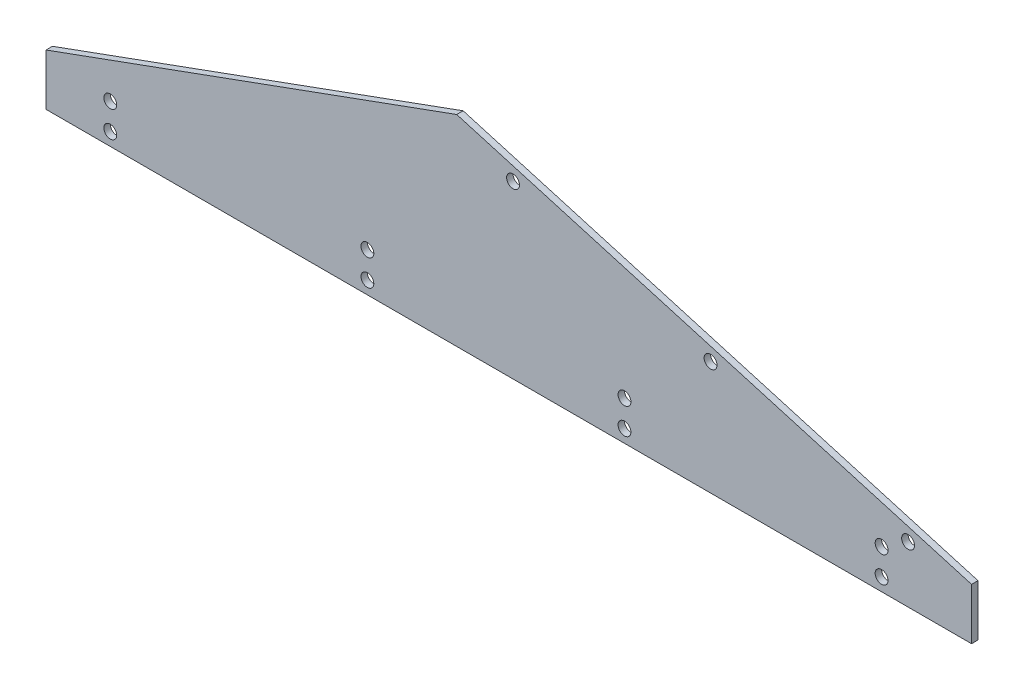
ISO-10303-21;
HEADER;
FILE_DESCRIPTION(('STEP AP214'),'2;1');
FILE_NAME('part.step','',(''),(''),'','','');
FILE_SCHEMA(('AUTOMOTIVE_DESIGN { 1 0 10303 214 1 1 1 1 }'));
ENDSEC;
DATA;
#1=APPLICATION_CONTEXT('core data for automotive mechanical design processes');
#2=APPLICATION_PROTOCOL_DEFINITION('international standard','automotive_design',2000,#1);
#3=PRODUCT_CONTEXT('',#1,'mechanical');
#4=PRODUCT('Part','Part','',(#3));
#5=PRODUCT_RELATED_PRODUCT_CATEGORY('part','',(#4));
#6=PRODUCT_DEFINITION_FORMATION('','',#4);
#7=PRODUCT_DEFINITION_CONTEXT('part definition',#1,'design');
#8=PRODUCT_DEFINITION('design','',#6,#7);
#9=PRODUCT_DEFINITION_SHAPE('','',#8);
#10=(LENGTH_UNIT() NAMED_UNIT(*) SI_UNIT(.MILLI.,.METRE.));
#11=(NAMED_UNIT(*) PLANE_ANGLE_UNIT() SI_UNIT($,.RADIAN.));
#12=(NAMED_UNIT(*) SI_UNIT($,.STERADIAN.) SOLID_ANGLE_UNIT());
#13=UNCERTAINTY_MEASURE_WITH_UNIT(LENGTH_MEASURE(1.E-05),#10,'distance_accuracy_value','');
#14=(GEOMETRIC_REPRESENTATION_CONTEXT(3) GLOBAL_UNCERTAINTY_ASSIGNED_CONTEXT((#13)) GLOBAL_UNIT_ASSIGNED_CONTEXT((#10,
#11,#12)) REPRESENTATION_CONTEXT('',''));
#15=CARTESIAN_POINT('',(0.,0.,0.));
#16=DIRECTION('',(0.,0.,1.));
#17=DIRECTION('',(1.,0.,0.));
#18=AXIS2_PLACEMENT_3D('',#15,#16,#17);
#19=CARTESIAN_POINT('',(0.,0.,3.175));
#20=DIRECTION('',(0.,0.,1.));
#21=DIRECTION('',(1.,0.,0.));
#22=AXIS2_PLACEMENT_3D('',#19,#20,#21);
#23=PLANE('',#22);
#24=CARTESIAN_POINT('',(285.75,6.35,3.175));
#25=DIRECTION('',(0.,0.,1.));
#26=DIRECTION('',(1.,0.,0.));
#27=AXIS2_PLACEMENT_3D('',#24,#25,#26);
#28=CIRCLE('',#27,3.17499999999997);
#29=CARTESIAN_POINT('',(288.925,6.35,3.175));
#30=VERTEX_POINT('',#29);
#31=EDGE_CURVE('E210',#30,#30,#28,.T.);
#32=ORIENTED_EDGE('',*,*,#31,.F.);
#33=EDGE_LOOP('',(#32));
#34=FACE_BOUND('',#33,.T.);
#35=CARTESIAN_POINT('',(412.75,19.3018477189735,3.175));
#36=DIRECTION('',(0.,0.,1.));
#37=DIRECTION('',(1.,0.,0.));
#38=AXIS2_PLACEMENT_3D('',#35,#36,#37);
#39=CIRCLE('',#38,3.17499999999997);
#40=CARTESIAN_POINT('',(415.925,19.3018477189735,3.175));
#41=VERTEX_POINT('',#40);
#42=EDGE_CURVE('E222',#41,#41,#39,.T.);
#43=ORIENTED_EDGE('',*,*,#42,.F.);
#44=EDGE_LOOP('',(#43));
#45=FACE_BOUND('',#44,.T.);
#46=CARTESIAN_POINT('',(158.75,19.3018477189735,3.175));
#47=DIRECTION('',(0.,0.,1.));
#48=DIRECTION('',(1.,0.,0.));
#49=AXIS2_PLACEMENT_3D('',#46,#47,#48);
#50=CIRCLE('',#49,3.175);
#51=CARTESIAN_POINT('',(161.925,19.3018477189735,3.175));
#52=VERTEX_POINT('',#51);
#53=EDGE_CURVE('E234',#52,#52,#50,.T.);
#54=ORIENTED_EDGE('',*,*,#53,.F.);
#55=EDGE_LOOP('',(#54));
#56=FACE_BOUND('',#55,.T.);
#57=CARTESIAN_POINT('',(31.75,19.3018477189735,3.175));
#58=DIRECTION('',(0.,0.,1.));
#59=DIRECTION('',(1.,0.,0.));
#60=AXIS2_PLACEMENT_3D('',#57,#58,#59);
#61=CIRCLE('',#60,3.175);
#62=CARTESIAN_POINT('',(34.925,19.3018477189735,3.175));
#63=VERTEX_POINT('',#62);
#64=EDGE_CURVE('E246',#63,#63,#61,.T.);
#65=ORIENTED_EDGE('',*,*,#64,.F.);
#66=EDGE_LOOP('',(#65));
#67=FACE_BOUND('',#66,.T.);
#68=CARTESIAN_POINT('',(328.269214348156,56.2229221909792,3.175));
#69=DIRECTION('',(0.,0.,1.));
#70=DIRECTION('',(1.,0.,0.));
#71=AXIS2_PLACEMENT_3D('',#68,#69,#70);
#72=CIRCLE('',#71,3.17499999999997);
#73=CARTESIAN_POINT('',(331.444214348156,56.2229221909792,3.175));
#74=VERTEX_POINT('',#73);
#75=EDGE_CURVE('E258',#74,#74,#72,.T.);
#76=ORIENTED_EDGE('',*,*,#75,.F.);
#77=EDGE_LOOP('',(#76));
#78=FACE_BOUND('',#77,.T.);
#79=DIRECTION('',(0.,-1.,0.));
#80=VECTOR('',#79,1.);
#81=CARTESIAN_POINT('',(0.,25.4,3.175));
#82=LINE('',#81,#80);
#83=CARTESIAN_POINT('',(0.,25.4,3.175));
#84=VERTEX_POINT('',#83);
#85=CARTESIAN_POINT('',(0.,0.,3.175));
#86=VERTEX_POINT('',#85);
#87=EDGE_CURVE('E127',#84,#86,#82,.T.);
#88=ORIENTED_EDGE('',*,*,#87,.T.);
#89=DIRECTION('',(1.,0.,0.));
#90=VECTOR('',#89,1.);
#91=CARTESIAN_POINT('',(0.,0.,3.175));
#92=LINE('',#91,#90);
#93=CARTESIAN_POINT('',(457.2,0.,3.175));
#94=VERTEX_POINT('',#93);
#95=EDGE_CURVE('E94',#86,#94,#92,.T.);
#96=ORIENTED_EDGE('',*,*,#95,.T.);
#97=DIRECTION('',(0.,1.,0.));
#98=VECTOR('',#97,1.);
#99=CARTESIAN_POINT('',(457.2,0.,3.175));
#100=LINE('',#99,#98);
#101=CARTESIAN_POINT('',(457.2,25.4,3.175));
#102=VERTEX_POINT('',#101);
#103=EDGE_CURVE('E98',#94,#102,#100,.T.);
#104=ORIENTED_EDGE('',*,*,#103,.T.);
#105=DIRECTION('',(-0.960338941893926,0.278835285934285,0.));
#106=VECTOR('',#105,1.);
#107=CARTESIAN_POINT('',(457.2,25.4,3.175));
#108=LINE('',#107,#106);
#109=CARTESIAN_POINT('',(202.879636827678,99.2421489440113,3.175));
#110=VERTEX_POINT('',#109);
#111=EDGE_CURVE('E102',#102,#110,#108,.T.);
#112=ORIENTED_EDGE('',*,*,#111,.T.);
#113=DIRECTION('',(-0.939692620785909,-0.342020143325666,0.));
#114=VECTOR('',#113,1.);
#115=CARTESIAN_POINT('',(202.879636827678,99.2421489440113,3.175));
#116=LINE('',#115,#114);
#117=EDGE_CURVE('E60',#110,#84,#116,.T.);
#118=ORIENTED_EDGE('',*,*,#117,.T.);
#119=EDGE_LOOP('',(#88,#96,#104,#112,#118));
#120=FACE_BOUND('',#119,.T.);
#121=CARTESIAN_POINT('',(230.698777851733,84.5525872419025,3.175));
#122=DIRECTION('',(0.,0.,1.));
#123=DIRECTION('',(1.,0.,0.));
#124=AXIS2_PLACEMENT_3D('',#121,#122,#123);
#125=CIRCLE('',#124,3.17499999999997);
#126=CARTESIAN_POINT('',(233.873777851733,84.5525872419025,3.175));
#127=VERTEX_POINT('',#126);
#128=EDGE_CURVE('E122',#127,#127,#125,.T.);
#129=ORIENTED_EDGE('',*,*,#128,.F.);
#130=EDGE_LOOP('',(#129));
#131=FACE_BOUND('',#130,.T.);
#132=CARTESIAN_POINT('',(425.839650844579,27.8932571400559,3.175));
#133=DIRECTION('',(0.,0.,1.));
#134=DIRECTION('',(1.,0.,0.));
#135=AXIS2_PLACEMENT_3D('',#132,#133,#134);
#136=CIRCLE('',#135,3.17499999999997);
#137=CARTESIAN_POINT('',(429.014650844579,27.8932571400559,3.175));
#138=VERTEX_POINT('',#137);
#139=EDGE_CURVE('E252',#138,#138,#136,.T.);
#140=ORIENTED_EDGE('',*,*,#139,.F.);
#141=EDGE_LOOP('',(#140));
#142=FACE_BOUND('',#141,.T.);
#143=CARTESIAN_POINT('',(31.75,6.35,3.175));
#144=DIRECTION('',(0.,0.,1.));
#145=DIRECTION('',(1.,0.,0.));
#146=AXIS2_PLACEMENT_3D('',#143,#144,#145);
#147=CIRCLE('',#146,3.175);
#148=CARTESIAN_POINT('',(34.925,6.35,3.175));
#149=VERTEX_POINT('',#148);
#150=EDGE_CURVE('E240',#149,#149,#147,.T.);
#151=ORIENTED_EDGE('',*,*,#150,.F.);
#152=EDGE_LOOP('',(#151));
#153=FACE_BOUND('',#152,.T.);
#154=CARTESIAN_POINT('',(285.75,19.3018477189735,3.175));
#155=DIRECTION('',(0.,0.,1.));
#156=DIRECTION('',(1.,0.,0.));
#157=AXIS2_PLACEMENT_3D('',#154,#155,#156);
#158=CIRCLE('',#157,3.17499999999997);
#159=CARTESIAN_POINT('',(288.925,19.3018477189735,3.175));
#160=VERTEX_POINT('',#159);
#161=EDGE_CURVE('E228',#160,#160,#158,.T.);
#162=ORIENTED_EDGE('',*,*,#161,.F.);
#163=EDGE_LOOP('',(#162));
#164=FACE_BOUND('',#163,.T.);
#165=CARTESIAN_POINT('',(158.75,6.35,3.175));
#166=DIRECTION('',(0.,0.,1.));
#167=DIRECTION('',(1.,0.,0.));
#168=AXIS2_PLACEMENT_3D('',#165,#166,#167);
#169=CIRCLE('',#168,3.175);
#170=CARTESIAN_POINT('',(161.925,6.35,3.175));
#171=VERTEX_POINT('',#170);
#172=EDGE_CURVE('E216',#171,#171,#169,.T.);
#173=ORIENTED_EDGE('',*,*,#172,.F.);
#174=EDGE_LOOP('',(#173));
#175=FACE_BOUND('',#174,.T.);
#176=CARTESIAN_POINT('',(412.75,6.35,3.175));
#177=DIRECTION('',(0.,0.,1.));
#178=DIRECTION('',(1.,0.,0.));
#179=AXIS2_PLACEMENT_3D('',#176,#177,#178);
#180=CIRCLE('',#179,3.17499999999997);
#181=CARTESIAN_POINT('',(415.925,6.35,3.175));
#182=VERTEX_POINT('',#181);
#183=EDGE_CURVE('E201',#182,#182,#180,.T.);
#184=ORIENTED_EDGE('',*,*,#183,.F.);
#185=EDGE_LOOP('',(#184));
#186=FACE_BOUND('',#185,.T.);
#187=ADVANCED_FACE('F43',(#34,#45,#56,#67,#78,#120,#131,#142,#153,#164,#175,#186),#23,.T.);
#188=CARTESIAN_POINT('',(0.,0.,0.));
#189=DIRECTION('',(0.,0.,1.));
#190=DIRECTION('',(1.,0.,0.));
#191=AXIS2_PLACEMENT_3D('',#188,#189,#190);
#192=PLANE('',#191);
#193=DIRECTION('',(0.,-1.,0.));
#194=VECTOR('',#193,1.);
#195=CARTESIAN_POINT('',(0.,25.4,0.));
#196=LINE('',#195,#194);
#197=CARTESIAN_POINT('',(0.,25.4,0.));
#198=VERTEX_POINT('',#197);
#199=CARTESIAN_POINT('',(0.,0.,0.));
#200=VERTEX_POINT('',#199);
#201=EDGE_CURVE('E118',#198,#200,#196,.T.);
#202=ORIENTED_EDGE('',*,*,#201,.F.);
#203=DIRECTION('',(-0.939692620785909,-0.342020143325666,0.));
#204=VECTOR('',#203,1.);
#205=CARTESIAN_POINT('',(202.879636827678,99.2421489440113,0.));
#206=LINE('',#205,#204);
#207=CARTESIAN_POINT('',(202.879636827678,99.2421489440113,0.));
#208=VERTEX_POINT('',#207);
#209=EDGE_CURVE('E86',#208,#198,#206,.T.);
#210=ORIENTED_EDGE('',*,*,#209,.F.);
#211=DIRECTION('',(-0.960338941893926,0.278835285934285,0.));
#212=VECTOR('',#211,1.);
#213=CARTESIAN_POINT('',(457.2,25.4,0.));
#214=LINE('',#213,#212);
#215=CARTESIAN_POINT('',(457.2,25.4,0.));
#216=VERTEX_POINT('',#215);
#217=EDGE_CURVE('E80',#216,#208,#214,.T.);
#218=ORIENTED_EDGE('',*,*,#217,.F.);
#219=DIRECTION('',(0.,1.,0.));
#220=VECTOR('',#219,1.);
#221=CARTESIAN_POINT('',(457.2,0.,0.));
#222=LINE('',#221,#220);
#223=CARTESIAN_POINT('',(457.2,0.,0.));
#224=VERTEX_POINT('',#223);
#225=EDGE_CURVE('E109',#224,#216,#222,.T.);
#226=ORIENTED_EDGE('',*,*,#225,.F.);
#227=DIRECTION('',(1.,0.,0.));
#228=VECTOR('',#227,1.);
#229=CARTESIAN_POINT('',(0.,0.,0.));
#230=LINE('',#229,#228);
#231=EDGE_CURVE('E121',#200,#224,#230,.T.);
#232=ORIENTED_EDGE('',*,*,#231,.F.);
#233=EDGE_LOOP('',(#202,#210,#218,#226,#232));
#234=FACE_BOUND('',#233,.T.);
#235=CARTESIAN_POINT('',(230.698777851733,84.5525872419025,0.));
#236=DIRECTION('',(0.,0.,1.));
#237=DIRECTION('',(1.,0.,0.));
#238=AXIS2_PLACEMENT_3D('',#235,#236,#237);
#239=CIRCLE('',#238,3.17499999999997);
#240=CARTESIAN_POINT('',(233.873777851733,84.5525872419025,0.));
#241=VERTEX_POINT('',#240);
#242=EDGE_CURVE('E261',#241,#241,#239,.T.);
#243=ORIENTED_EDGE('',*,*,#242,.T.);
#244=EDGE_LOOP('',(#243));
#245=FACE_BOUND('',#244,.T.);
#246=CARTESIAN_POINT('',(328.269214348156,56.2229221909792,0.));
#247=DIRECTION('',(0.,0.,1.));
#248=DIRECTION('',(1.,0.,0.));
#249=AXIS2_PLACEMENT_3D('',#246,#247,#248);
#250=CIRCLE('',#249,3.17499999999997);
#251=CARTESIAN_POINT('',(331.444214348156,56.2229221909792,0.));
#252=VERTEX_POINT('',#251);
#253=EDGE_CURVE('E255',#252,#252,#250,.T.);
#254=ORIENTED_EDGE('',*,*,#253,.T.);
#255=EDGE_LOOP('',(#254));
#256=FACE_BOUND('',#255,.T.);
#257=CARTESIAN_POINT('',(425.839650844579,27.8932571400559,0.));
#258=DIRECTION('',(0.,0.,1.));
#259=DIRECTION('',(1.,0.,0.));
#260=AXIS2_PLACEMENT_3D('',#257,#258,#259);
#261=CIRCLE('',#260,3.17499999999997);
#262=CARTESIAN_POINT('',(429.014650844579,27.8932571400559,0.));
#263=VERTEX_POINT('',#262);
#264=EDGE_CURVE('E249',#263,#263,#261,.T.);
#265=ORIENTED_EDGE('',*,*,#264,.T.);
#266=EDGE_LOOP('',(#265));
#267=FACE_BOUND('',#266,.T.);
#268=CARTESIAN_POINT('',(31.75,19.3018477189735,0.));
#269=DIRECTION('',(0.,0.,1.));
#270=DIRECTION('',(1.,0.,0.));
#271=AXIS2_PLACEMENT_3D('',#268,#269,#270);
#272=CIRCLE('',#271,3.175);
#273=CARTESIAN_POINT('',(34.925,19.3018477189735,0.));
#274=VERTEX_POINT('',#273);
#275=EDGE_CURVE('E243',#274,#274,#272,.T.);
#276=ORIENTED_EDGE('',*,*,#275,.T.);
#277=EDGE_LOOP('',(#276));
#278=FACE_BOUND('',#277,.T.);
#279=CARTESIAN_POINT('',(31.75,6.35,0.));
#280=DIRECTION('',(0.,0.,1.));
#281=DIRECTION('',(1.,0.,0.));
#282=AXIS2_PLACEMENT_3D('',#279,#280,#281);
#283=CIRCLE('',#282,3.175);
#284=CARTESIAN_POINT('',(34.925,6.35,0.));
#285=VERTEX_POINT('',#284);
#286=EDGE_CURVE('E237',#285,#285,#283,.T.);
#287=ORIENTED_EDGE('',*,*,#286,.T.);
#288=EDGE_LOOP('',(#287));
#289=FACE_BOUND('',#288,.T.);
#290=CARTESIAN_POINT('',(158.75,19.3018477189735,0.));
#291=DIRECTION('',(0.,0.,1.));
#292=DIRECTION('',(1.,0.,0.));
#293=AXIS2_PLACEMENT_3D('',#290,#291,#292);
#294=CIRCLE('',#293,3.175);
#295=CARTESIAN_POINT('',(161.925,19.3018477189735,0.));
#296=VERTEX_POINT('',#295);
#297=EDGE_CURVE('E231',#296,#296,#294,.T.);
#298=ORIENTED_EDGE('',*,*,#297,.T.);
#299=EDGE_LOOP('',(#298));
#300=FACE_BOUND('',#299,.T.);
#301=CARTESIAN_POINT('',(285.75,19.3018477189735,0.));
#302=DIRECTION('',(0.,0.,1.));
#303=DIRECTION('',(1.,0.,0.));
#304=AXIS2_PLACEMENT_3D('',#301,#302,#303);
#305=CIRCLE('',#304,3.17499999999997);
#306=CARTESIAN_POINT('',(288.925,19.3018477189735,0.));
#307=VERTEX_POINT('',#306);
#308=EDGE_CURVE('E225',#307,#307,#305,.T.);
#309=ORIENTED_EDGE('',*,*,#308,.T.);
#310=EDGE_LOOP('',(#309));
#311=FACE_BOUND('',#310,.T.);
#312=CARTESIAN_POINT('',(412.75,19.3018477189735,0.));
#313=DIRECTION('',(0.,0.,1.));
#314=DIRECTION('',(1.,0.,0.));
#315=AXIS2_PLACEMENT_3D('',#312,#313,#314);
#316=CIRCLE('',#315,3.17499999999997);
#317=CARTESIAN_POINT('',(415.925,19.3018477189735,0.));
#318=VERTEX_POINT('',#317);
#319=EDGE_CURVE('E219',#318,#318,#316,.T.);
#320=ORIENTED_EDGE('',*,*,#319,.T.);
#321=EDGE_LOOP('',(#320));
#322=FACE_BOUND('',#321,.T.);
#323=CARTESIAN_POINT('',(158.75,6.35,0.));
#324=DIRECTION('',(0.,0.,1.));
#325=DIRECTION('',(1.,0.,0.));
#326=AXIS2_PLACEMENT_3D('',#323,#324,#325);
#327=CIRCLE('',#326,3.175);
#328=CARTESIAN_POINT('',(161.925,6.35,0.));
#329=VERTEX_POINT('',#328);
#330=EDGE_CURVE('E213',#329,#329,#327,.T.);
#331=ORIENTED_EDGE('',*,*,#330,.T.);
#332=EDGE_LOOP('',(#331));
#333=FACE_BOUND('',#332,.T.);
#334=CARTESIAN_POINT('',(285.75,6.35,0.));
#335=DIRECTION('',(0.,0.,1.));
#336=DIRECTION('',(1.,0.,0.));
#337=AXIS2_PLACEMENT_3D('',#334,#335,#336);
#338=CIRCLE('',#337,3.17499999999997);
#339=CARTESIAN_POINT('',(288.925,6.35,0.));
#340=VERTEX_POINT('',#339);
#341=EDGE_CURVE('E207',#340,#340,#338,.T.);
#342=ORIENTED_EDGE('',*,*,#341,.T.);
#343=EDGE_LOOP('',(#342));
#344=FACE_BOUND('',#343,.T.);
#345=CARTESIAN_POINT('',(412.75,6.35,0.));
#346=DIRECTION('',(0.,0.,1.));
#347=DIRECTION('',(1.,0.,0.));
#348=AXIS2_PLACEMENT_3D('',#345,#346,#347);
#349=CIRCLE('',#348,3.17499999999997);
#350=CARTESIAN_POINT('',(415.925,6.35,0.));
#351=VERTEX_POINT('',#350);
#352=EDGE_CURVE('E204',#351,#351,#349,.T.);
#353=ORIENTED_EDGE('',*,*,#352,.T.);
#354=EDGE_LOOP('',(#353));
#355=FACE_BOUND('',#354,.T.);
#356=ADVANCED_FACE('F131',(#234,#245,#256,#267,#278,#289,#300,#311,#322,#333,#344,#355),#192,.F.);
#357=CARTESIAN_POINT('',(0.,25.4,3.175));
#358=DIRECTION('',(1.,0.,0.));
#359=DIRECTION('',(0.,1.,0.));
#360=AXIS2_PLACEMENT_3D('',#357,#358,#359);
#361=PLANE('',#360);
#362=ORIENTED_EDGE('',*,*,#201,.T.);
#363=DIRECTION('',(0.,0.,-1.));
#364=VECTOR('',#363,1.);
#365=CARTESIAN_POINT('',(0.,0.,3.175));
#366=LINE('',#365,#364);
#367=EDGE_CURVE('E11',#86,#200,#366,.T.);
#368=ORIENTED_EDGE('',*,*,#367,.F.);
#369=ORIENTED_EDGE('',*,*,#87,.F.);
#370=DIRECTION('',(0.,0.,-1.));
#371=VECTOR('',#370,1.);
#372=CARTESIAN_POINT('',(0.,25.4,3.175));
#373=LINE('',#372,#371);
#374=EDGE_CURVE('E114',#84,#198,#373,.T.);
#375=ORIENTED_EDGE('',*,*,#374,.T.);
#376=EDGE_LOOP('',(#362,#368,#369,#375));
#377=FACE_BOUND('',#376,.T.);
#378=ADVANCED_FACE('F45',(#377),#361,.F.);
#379=CARTESIAN_POINT('',(0.,0.,3.175));
#380=DIRECTION('',(0.,1.,0.));
#381=DIRECTION('',(0.,0.,1.));
#382=AXIS2_PLACEMENT_3D('',#379,#380,#381);
#383=PLANE('',#382);
#384=ORIENTED_EDGE('',*,*,#231,.T.);
#385=DIRECTION('',(0.,0.,-1.));
#386=VECTOR('',#385,1.);
#387=CARTESIAN_POINT('',(457.2,0.,3.175));
#388=LINE('',#387,#386);
#389=EDGE_CURVE('E52',#94,#224,#388,.T.);
#390=ORIENTED_EDGE('',*,*,#389,.F.);
#391=ORIENTED_EDGE('',*,*,#95,.F.);
#392=ORIENTED_EDGE('',*,*,#367,.T.);
#393=EDGE_LOOP('',(#384,#390,#391,#392));
#394=FACE_BOUND('',#393,.T.);
#395=ADVANCED_FACE('F384',(#394),#383,.F.);
#396=CARTESIAN_POINT('',(457.2,0.,3.175));
#397=DIRECTION('',(-1.,0.,0.));
#398=DIRECTION('',(0.,0.,1.));
#399=AXIS2_PLACEMENT_3D('',#396,#397,#398);
#400=PLANE('',#399);
#401=ORIENTED_EDGE('',*,*,#225,.T.);
#402=DIRECTION('',(0.,0.,-1.));
#403=VECTOR('',#402,1.);
#404=CARTESIAN_POINT('',(457.2,25.4,3.175));
#405=LINE('',#404,#403);
#406=EDGE_CURVE('E106',#102,#216,#405,.T.);
#407=ORIENTED_EDGE('',*,*,#406,.F.);
#408=ORIENTED_EDGE('',*,*,#103,.F.);
#409=ORIENTED_EDGE('',*,*,#389,.T.);
#410=EDGE_LOOP('',(#401,#407,#408,#409));
#411=FACE_BOUND('',#410,.T.);
#412=ADVANCED_FACE('F107',(#411),#400,.F.);
#413=CARTESIAN_POINT('',(457.2,25.4,3.175));
#414=DIRECTION('',(-0.278835285934285,-0.960338941893926,0.));
#415=DIRECTION('',(0.960338941893926,-0.278835285934285,0.));
#416=AXIS2_PLACEMENT_3D('',#413,#414,#415);
#417=PLANE('',#416);
#418=ORIENTED_EDGE('',*,*,#217,.T.);
#419=DIRECTION('',(0.,0.,-1.));
#420=VECTOR('',#419,1.);
#421=CARTESIAN_POINT('',(202.879636827678,99.2421489440113,3.175));
#422=LINE('',#421,#420);
#423=EDGE_CURVE('E110',#110,#208,#422,.T.);
#424=ORIENTED_EDGE('',*,*,#423,.F.);
#425=ORIENTED_EDGE('',*,*,#111,.F.);
#426=ORIENTED_EDGE('',*,*,#406,.T.);
#427=EDGE_LOOP('',(#418,#424,#425,#426));
#428=FACE_BOUND('',#427,.T.);
#429=ADVANCED_FACE('F112',(#428),#417,.F.);
#430=CARTESIAN_POINT('',(202.879636827678,99.2421489440113,3.175));
#431=DIRECTION('',(0.342020143325666,-0.939692620785909,0.));
#432=DIRECTION('',(0.939692620785909,0.342020143325666,0.));
#433=AXIS2_PLACEMENT_3D('',#430,#431,#432);
#434=PLANE('',#433);
#435=ORIENTED_EDGE('',*,*,#209,.T.);
#436=ORIENTED_EDGE('',*,*,#374,.F.);
#437=ORIENTED_EDGE('',*,*,#117,.F.);
#438=ORIENTED_EDGE('',*,*,#423,.T.);
#439=EDGE_LOOP('',(#435,#436,#437,#438));
#440=FACE_BOUND('',#439,.T.);
#441=ADVANCED_FACE('F136',(#440),#434,.F.);
#442=CARTESIAN_POINT('',(230.698777851733,84.5525872419025,3.175));
#443=DIRECTION('',(0.,0.,-1.));
#444=DIRECTION('',(-1.,0.,0.));
#445=AXIS2_PLACEMENT_3D('',#442,#443,#444);
#446=CYLINDRICAL_SURFACE('',#445,3.17499999999997);
#447=ORIENTED_EDGE('',*,*,#128,.T.);
#448=EDGE_LOOP('',(#447));
#449=FACE_BOUND('',#448,.T.);
#450=ORIENTED_EDGE('',*,*,#242,.F.);
#451=EDGE_LOOP('',(#450));
#452=FACE_BOUND('',#451,.T.);
#453=ADVANCED_FACE('F138',(#449,#452),#446,.F.);
#454=CARTESIAN_POINT('',(328.269214348156,56.2229221909792,3.175));
#455=DIRECTION('',(0.,0.,-1.));
#456=DIRECTION('',(-1.,0.,0.));
#457=AXIS2_PLACEMENT_3D('',#454,#455,#456);
#458=CYLINDRICAL_SURFACE('',#457,3.17499999999997);
#459=ORIENTED_EDGE('',*,*,#75,.T.);
#460=EDGE_LOOP('',(#459));
#461=FACE_BOUND('',#460,.T.);
#462=ORIENTED_EDGE('',*,*,#253,.F.);
#463=EDGE_LOOP('',(#462));
#464=FACE_BOUND('',#463,.T.);
#465=ADVANCED_FACE('F144',(#461,#464),#458,.F.);
#466=CARTESIAN_POINT('',(425.839650844579,27.8932571400559,3.175));
#467=DIRECTION('',(0.,0.,-1.));
#468=DIRECTION('',(-1.,0.,0.));
#469=AXIS2_PLACEMENT_3D('',#466,#467,#468);
#470=CYLINDRICAL_SURFACE('',#469,3.17499999999997);
#471=ORIENTED_EDGE('',*,*,#139,.T.);
#472=EDGE_LOOP('',(#471));
#473=FACE_BOUND('',#472,.T.);
#474=ORIENTED_EDGE('',*,*,#264,.F.);
#475=EDGE_LOOP('',(#474));
#476=FACE_BOUND('',#475,.T.);
#477=ADVANCED_FACE('F160',(#473,#476),#470,.F.);
#478=CARTESIAN_POINT('',(31.75,19.3018477189735,3.175));
#479=DIRECTION('',(0.,0.,-1.));
#480=DIRECTION('',(-1.,0.,0.));
#481=AXIS2_PLACEMENT_3D('',#478,#479,#480);
#482=CYLINDRICAL_SURFACE('',#481,3.175);
#483=ORIENTED_EDGE('',*,*,#64,.T.);
#484=EDGE_LOOP('',(#483));
#485=FACE_BOUND('',#484,.T.);
#486=ORIENTED_EDGE('',*,*,#275,.F.);
#487=EDGE_LOOP('',(#486));
#488=FACE_BOUND('',#487,.T.);
#489=ADVANCED_FACE('F164',(#485,#488),#482,.F.);
#490=CARTESIAN_POINT('',(31.75,6.35,3.175));
#491=DIRECTION('',(0.,0.,-1.));
#492=DIRECTION('',(-1.,0.,0.));
#493=AXIS2_PLACEMENT_3D('',#490,#491,#492);
#494=CYLINDRICAL_SURFACE('',#493,3.175);
#495=ORIENTED_EDGE('',*,*,#150,.T.);
#496=EDGE_LOOP('',(#495));
#497=FACE_BOUND('',#496,.T.);
#498=ORIENTED_EDGE('',*,*,#286,.F.);
#499=EDGE_LOOP('',(#498));
#500=FACE_BOUND('',#499,.T.);
#501=ADVANCED_FACE('F168',(#497,#500),#494,.F.);
#502=CARTESIAN_POINT('',(158.75,19.3018477189735,3.175));
#503=DIRECTION('',(0.,0.,-1.));
#504=DIRECTION('',(-1.,0.,0.));
#505=AXIS2_PLACEMENT_3D('',#502,#503,#504);
#506=CYLINDRICAL_SURFACE('',#505,3.175);
#507=ORIENTED_EDGE('',*,*,#53,.T.);
#508=EDGE_LOOP('',(#507));
#509=FACE_BOUND('',#508,.T.);
#510=ORIENTED_EDGE('',*,*,#297,.F.);
#511=EDGE_LOOP('',(#510));
#512=FACE_BOUND('',#511,.T.);
#513=ADVANCED_FACE('F172',(#509,#512),#506,.F.);
#514=CARTESIAN_POINT('',(285.75,19.3018477189735,3.175));
#515=DIRECTION('',(0.,0.,-1.));
#516=DIRECTION('',(-1.,0.,0.));
#517=AXIS2_PLACEMENT_3D('',#514,#515,#516);
#518=CYLINDRICAL_SURFACE('',#517,3.17499999999997);
#519=ORIENTED_EDGE('',*,*,#161,.T.);
#520=EDGE_LOOP('',(#519));
#521=FACE_BOUND('',#520,.T.);
#522=ORIENTED_EDGE('',*,*,#308,.F.);
#523=EDGE_LOOP('',(#522));
#524=FACE_BOUND('',#523,.T.);
#525=ADVANCED_FACE('F176',(#521,#524),#518,.F.);
#526=CARTESIAN_POINT('',(412.75,19.3018477189735,3.175));
#527=DIRECTION('',(0.,0.,-1.));
#528=DIRECTION('',(-1.,0.,0.));
#529=AXIS2_PLACEMENT_3D('',#526,#527,#528);
#530=CYLINDRICAL_SURFACE('',#529,3.17499999999997);
#531=ORIENTED_EDGE('',*,*,#42,.T.);
#532=EDGE_LOOP('',(#531));
#533=FACE_BOUND('',#532,.T.);
#534=ORIENTED_EDGE('',*,*,#319,.F.);
#535=EDGE_LOOP('',(#534));
#536=FACE_BOUND('',#535,.T.);
#537=ADVANCED_FACE('F180',(#533,#536),#530,.F.);
#538=CARTESIAN_POINT('',(158.75,6.35,3.175));
#539=DIRECTION('',(0.,0.,-1.));
#540=DIRECTION('',(-1.,0.,0.));
#541=AXIS2_PLACEMENT_3D('',#538,#539,#540);
#542=CYLINDRICAL_SURFACE('',#541,3.175);
#543=ORIENTED_EDGE('',*,*,#172,.T.);
#544=EDGE_LOOP('',(#543));
#545=FACE_BOUND('',#544,.T.);
#546=ORIENTED_EDGE('',*,*,#330,.F.);
#547=EDGE_LOOP('',(#546));
#548=FACE_BOUND('',#547,.T.);
#549=ADVANCED_FACE('F184',(#545,#548),#542,.F.);
#550=CARTESIAN_POINT('',(285.75,6.35,3.175));
#551=DIRECTION('',(0.,0.,-1.));
#552=DIRECTION('',(-1.,0.,0.));
#553=AXIS2_PLACEMENT_3D('',#550,#551,#552);
#554=CYLINDRICAL_SURFACE('',#553,3.17499999999997);
#555=ORIENTED_EDGE('',*,*,#31,.T.);
#556=EDGE_LOOP('',(#555));
#557=FACE_BOUND('',#556,.T.);
#558=ORIENTED_EDGE('',*,*,#341,.F.);
#559=EDGE_LOOP('',(#558));
#560=FACE_BOUND('',#559,.T.);
#561=ADVANCED_FACE('F188',(#557,#560),#554,.F.);
#562=CARTESIAN_POINT('',(412.75,6.35,3.175));
#563=DIRECTION('',(0.,0.,-1.));
#564=DIRECTION('',(-1.,0.,0.));
#565=AXIS2_PLACEMENT_3D('',#562,#563,#564);
#566=CYLINDRICAL_SURFACE('',#565,3.17499999999997);
#567=ORIENTED_EDGE('',*,*,#183,.T.);
#568=EDGE_LOOP('',(#567));
#569=FACE_BOUND('',#568,.T.);
#570=ORIENTED_EDGE('',*,*,#352,.F.);
#571=EDGE_LOOP('',(#570));
#572=FACE_BOUND('',#571,.T.);
#573=ADVANCED_FACE('F192',(#569,#572),#566,.F.);
#574=CLOSED_SHELL('',(#187,#356,#378,#395,#412,#429,#441,#453,#465,#477,#489,#501,#513,#525,
#537,#549,#561,#573));
#575=MANIFOLD_SOLID_BREP('B2',#574);
#576=ADVANCED_BREP_SHAPE_REPRESENTATION('',(#18,#575),#14);
#577=SHAPE_DEFINITION_REPRESENTATION(#9,#576);
ENDSEC;
END-ISO-10303-21;
